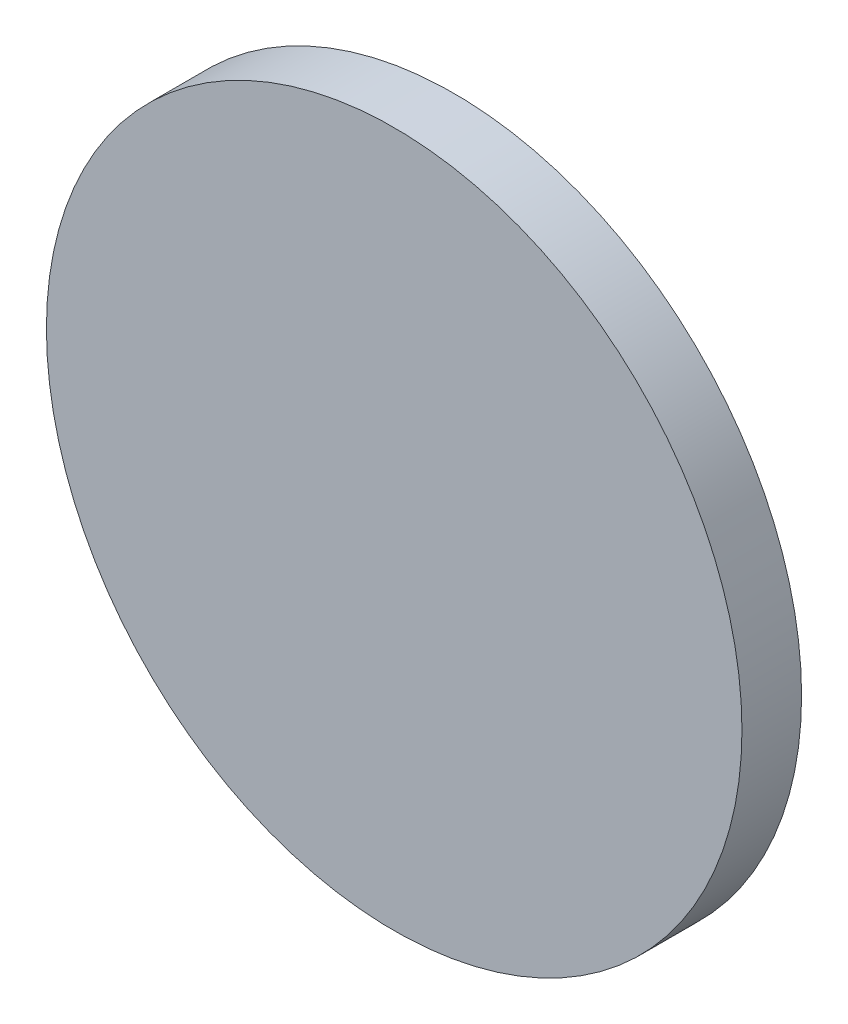
ISO-10303-21;
HEADER;
FILE_DESCRIPTION(('STEP AP214'),'2;1');
FILE_NAME('part.step','',(''),(''),'','','');
FILE_SCHEMA(('AUTOMOTIVE_DESIGN { 1 0 10303 214 1 1 1 1 }'));
ENDSEC;
DATA;
#1=APPLICATION_CONTEXT('core data for automotive mechanical design processes');
#2=APPLICATION_PROTOCOL_DEFINITION('international standard','automotive_design',2000,#1);
#3=PRODUCT_CONTEXT('',#1,'mechanical');
#4=PRODUCT('Part','Part','',(#3));
#5=PRODUCT_RELATED_PRODUCT_CATEGORY('part','',(#4));
#6=PRODUCT_DEFINITION_FORMATION('','',#4);
#7=PRODUCT_DEFINITION_CONTEXT('part definition',#1,'design');
#8=PRODUCT_DEFINITION('design','',#6,#7);
#9=PRODUCT_DEFINITION_SHAPE('','',#8);
#10=(LENGTH_UNIT() NAMED_UNIT(*) SI_UNIT(.MILLI.,.METRE.));
#11=(NAMED_UNIT(*) PLANE_ANGLE_UNIT() SI_UNIT($,.RADIAN.));
#12=(NAMED_UNIT(*) SI_UNIT($,.STERADIAN.) SOLID_ANGLE_UNIT());
#13=UNCERTAINTY_MEASURE_WITH_UNIT(LENGTH_MEASURE(1.E-05),#10,'distance_accuracy_value','');
#14=(GEOMETRIC_REPRESENTATION_CONTEXT(3) GLOBAL_UNCERTAINTY_ASSIGNED_CONTEXT((#13)) GLOBAL_UNIT_ASSIGNED_CONTEXT((#10,
#11,#12)) REPRESENTATION_CONTEXT('',''));
#15=CARTESIAN_POINT('',(0.,0.,0.));
#16=DIRECTION('',(0.,0.,1.));
#17=DIRECTION('',(1.,0.,0.));
#18=AXIS2_PLACEMENT_3D('',#15,#16,#17);
#19=CARTESIAN_POINT('',(0.711,1.201,0.76487));
#20=DIRECTION('',(0.,0.,-1.));
#21=DIRECTION('',(-1.,0.,0.));
#22=AXIS2_PLACEMENT_3D('',#19,#20,#21);
#23=PLANE('',#22);
#24=CARTESIAN_POINT('',(0.711,1.201,0.76487));
#25=DIRECTION('',(0.,0.,1.));
#26=DIRECTION('',(1.,0.,0.));
#27=AXIS2_PLACEMENT_3D('',#24,#25,#26);
#28=CIRCLE('',#27,0.200024667);
#29=CARTESIAN_POINT('',(0.911024667,1.201,0.76487));
#30=VERTEX_POINT('',#29);
#31=EDGE_CURVE('E18',#30,#30,#28,.T.);
#32=ORIENTED_EDGE('',*,*,#31,.F.);
#33=EDGE_LOOP('',(#32));
#34=FACE_BOUND('',#33,.T.);
#35=ADVANCED_FACE('F15',(#34),#23,.T.);
#36=CARTESIAN_POINT('',(0.711,1.201,0.76487));
#37=DIRECTION('',(0.,0.,1.));
#38=DIRECTION('',(1.,0.,0.));
#39=AXIS2_PLACEMENT_3D('',#36,#37,#38);
#40=CYLINDRICAL_SURFACE('',#39,0.200024667);
#41=CARTESIAN_POINT('',(0.711,1.201,0.79916));
#42=DIRECTION('',(0.,0.,1.));
#43=DIRECTION('',(1.,0.,0.));
#44=AXIS2_PLACEMENT_3D('',#41,#42,#43);
#45=CIRCLE('',#44,0.200024667);
#46=CARTESIAN_POINT('',(0.911024667,1.201,0.79916));
#47=VERTEX_POINT('',#46);
#48=EDGE_CURVE('E10',#47,#47,#45,.T.);
#49=ORIENTED_EDGE('',*,*,#48,.F.);
#50=EDGE_LOOP('',(#49));
#51=FACE_BOUND('',#50,.T.);
#52=ORIENTED_EDGE('',*,*,#31,.T.);
#53=EDGE_LOOP('',(#52));
#54=FACE_BOUND('',#53,.T.);
#55=ADVANCED_FACE('F27',(#51,#54),#40,.T.);
#56=CARTESIAN_POINT('',(0.711,1.201,0.79916));
#57=DIRECTION('',(0.,0.,1.));
#58=DIRECTION('',(1.,0.,0.));
#59=AXIS2_PLACEMENT_3D('',#56,#57,#58);
#60=PLANE('',#59);
#61=ORIENTED_EDGE('',*,*,#48,.T.);
#62=EDGE_LOOP('',(#61));
#63=FACE_BOUND('',#62,.T.);
#64=ADVANCED_FACE('F34',(#63),#60,.T.);
#65=CLOSED_SHELL('',(#35,#55,#64));
#66=MANIFOLD_SOLID_BREP('B1',#65);
#67=ADVANCED_BREP_SHAPE_REPRESENTATION('',(#18,#66),#14);
#68=SHAPE_DEFINITION_REPRESENTATION(#9,#67);
ENDSEC;
END-ISO-10303-21;
